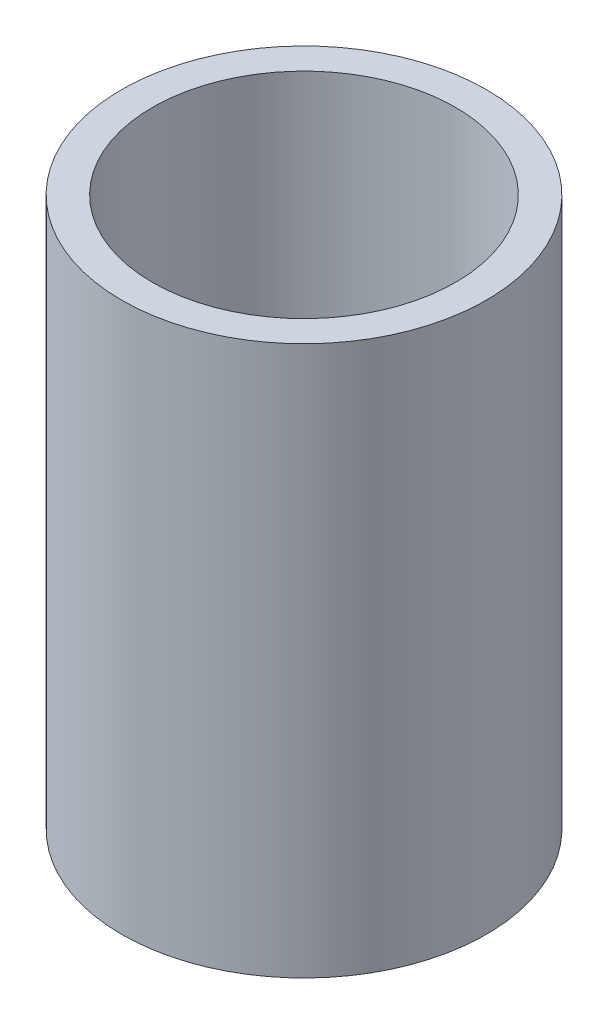
ISO-10303-21;
HEADER;
FILE_DESCRIPTION(('STEP AP214'),'2;1');
FILE_NAME('part.step','',(''),(''),'','','');
FILE_SCHEMA(('AUTOMOTIVE_DESIGN { 1 0 10303 214 1 1 1 1 }'));
ENDSEC;
DATA;
#1=APPLICATION_CONTEXT('core data for automotive mechanical design processes');
#2=APPLICATION_PROTOCOL_DEFINITION('international standard','automotive_design',2000,#1);
#3=PRODUCT_CONTEXT('',#1,'mechanical');
#4=PRODUCT('Part','Part','',(#3));
#5=PRODUCT_RELATED_PRODUCT_CATEGORY('part','',(#4));
#6=PRODUCT_DEFINITION_FORMATION('','',#4);
#7=PRODUCT_DEFINITION_CONTEXT('part definition',#1,'design');
#8=PRODUCT_DEFINITION('design','',#6,#7);
#9=PRODUCT_DEFINITION_SHAPE('','',#8);
#10=(LENGTH_UNIT() NAMED_UNIT(*) SI_UNIT(.MILLI.,.METRE.));
#11=(NAMED_UNIT(*) PLANE_ANGLE_UNIT() SI_UNIT($,.RADIAN.));
#12=(NAMED_UNIT(*) SI_UNIT($,.STERADIAN.) SOLID_ANGLE_UNIT());
#13=UNCERTAINTY_MEASURE_WITH_UNIT(LENGTH_MEASURE(1.E-05),#10,'distance_accuracy_value','');
#14=(GEOMETRIC_REPRESENTATION_CONTEXT(3) GLOBAL_UNCERTAINTY_ASSIGNED_CONTEXT((#13)) GLOBAL_UNIT_ASSIGNED_CONTEXT((#10,
#11,#12)) REPRESENTATION_CONTEXT('',''));
#15=CARTESIAN_POINT('',(0.,0.,0.));
#16=DIRECTION('',(0.,0.,1.));
#17=DIRECTION('',(1.,0.,0.));
#18=AXIS2_PLACEMENT_3D('',#15,#16,#17);
#19=CARTESIAN_POINT('',(0.,63.5,0.));
#20=DIRECTION('',(0.,1.,0.));
#21=DIRECTION('',(0.,0.,1.));
#22=AXIS2_PLACEMENT_3D('',#19,#20,#21);
#23=PLANE('',#22);
#24=CARTESIAN_POINT('',(0.,63.5,0.));
#25=DIRECTION('',(0.,1.,0.));
#26=DIRECTION('',(0.,0.,1.));
#27=AXIS2_PLACEMENT_3D('',#24,#25,#26);
#28=CIRCLE('',#27,21.082);
#29=CARTESIAN_POINT('',(0.,63.5,21.082));
#30=VERTEX_POINT('',#29);
#31=EDGE_CURVE('E10',#30,#30,#28,.T.);
#32=ORIENTED_EDGE('',*,*,#31,.T.);
#33=EDGE_LOOP('',(#32));
#34=FACE_BOUND('',#33,.T.);
#35=CARTESIAN_POINT('',(0.,63.5,0.));
#36=DIRECTION('',(0.,1.,0.));
#37=DIRECTION('',(0.,0.,1.));
#38=AXIS2_PLACEMENT_3D('',#35,#36,#37);
#39=CIRCLE('',#38,17.526);
#40=CARTESIAN_POINT('',(0.,63.5,17.526));
#41=VERTEX_POINT('',#40);
#42=EDGE_CURVE('E46',#41,#41,#39,.T.);
#43=ORIENTED_EDGE('',*,*,#42,.F.);
#44=EDGE_LOOP('',(#43));
#45=FACE_BOUND('',#44,.T.);
#46=ADVANCED_FACE('F35',(#34,#45),#23,.T.);
#47=CARTESIAN_POINT('',(0.,0.,0.));
#48=DIRECTION('',(0.,1.,0.));
#49=DIRECTION('',(0.,0.,1.));
#50=AXIS2_PLACEMENT_3D('',#47,#48,#49);
#51=PLANE('',#50);
#52=CARTESIAN_POINT('',(0.,0.,0.));
#53=DIRECTION('',(0.,1.,0.));
#54=DIRECTION('',(0.,0.,1.));
#55=AXIS2_PLACEMENT_3D('',#52,#53,#54);
#56=CIRCLE('',#55,21.082);
#57=CARTESIAN_POINT('',(0.,0.,21.082));
#58=VERTEX_POINT('',#57);
#59=EDGE_CURVE('E39',#58,#58,#56,.T.);
#60=ORIENTED_EDGE('',*,*,#59,.F.);
#61=EDGE_LOOP('',(#60));
#62=FACE_BOUND('',#61,.T.);
#63=CARTESIAN_POINT('',(0.,0.,0.));
#64=DIRECTION('',(0.,1.,0.));
#65=DIRECTION('',(0.,0.,1.));
#66=AXIS2_PLACEMENT_3D('',#63,#64,#65);
#67=CIRCLE('',#66,17.526);
#68=CARTESIAN_POINT('',(0.,0.,17.526));
#69=VERTEX_POINT('',#68);
#70=EDGE_CURVE('E48',#69,#69,#67,.T.);
#71=ORIENTED_EDGE('',*,*,#70,.T.);
#72=EDGE_LOOP('',(#71));
#73=FACE_BOUND('',#72,.T.);
#74=ADVANCED_FACE('F58',(#62,#73),#51,.F.);
#75=CARTESIAN_POINT('',(0.,63.5,0.));
#76=DIRECTION('',(0.,-1.,0.));
#77=DIRECTION('',(0.,0.,-1.));
#78=AXIS2_PLACEMENT_3D('',#75,#76,#77);
#79=CYLINDRICAL_SURFACE('',#78,21.082);
#80=ORIENTED_EDGE('',*,*,#31,.F.);
#81=EDGE_LOOP('',(#80));
#82=FACE_BOUND('',#81,.T.);
#83=ORIENTED_EDGE('',*,*,#59,.T.);
#84=EDGE_LOOP('',(#83));
#85=FACE_BOUND('',#84,.T.);
#86=ADVANCED_FACE('F37',(#82,#85),#79,.T.);
#87=CARTESIAN_POINT('',(0.,63.5,0.));
#88=DIRECTION('',(0.,-1.,0.));
#89=DIRECTION('',(0.,0.,-1.));
#90=AXIS2_PLACEMENT_3D('',#87,#88,#89);
#91=CYLINDRICAL_SURFACE('',#90,17.526);
#92=ORIENTED_EDGE('',*,*,#42,.T.);
#93=EDGE_LOOP('',(#92));
#94=FACE_BOUND('',#93,.T.);
#95=ORIENTED_EDGE('',*,*,#70,.F.);
#96=EDGE_LOOP('',(#95));
#97=FACE_BOUND('',#96,.T.);
#98=ADVANCED_FACE('F54',(#94,#97),#91,.F.);
#99=CLOSED_SHELL('',(#46,#74,#86,#98));
#100=MANIFOLD_SOLID_BREP('B2',#99);
#101=ADVANCED_BREP_SHAPE_REPRESENTATION('',(#18,#100),#14);
#102=SHAPE_DEFINITION_REPRESENTATION(#9,#101);
ENDSEC;
END-ISO-10303-21;
